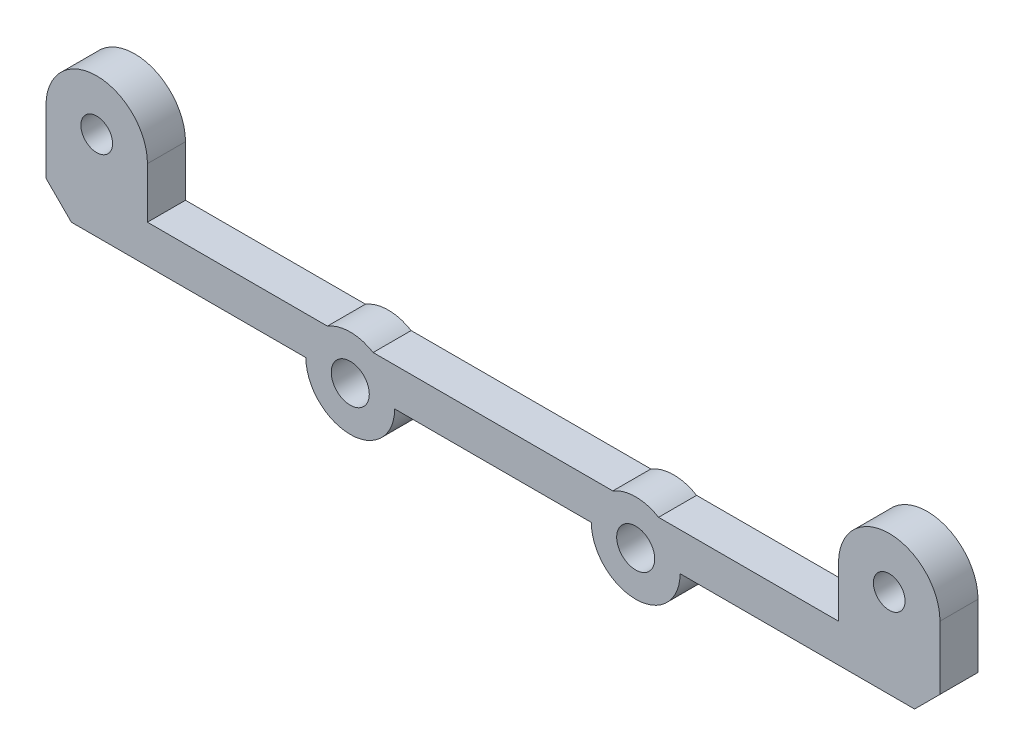
ISO-10303-21;
HEADER;
FILE_DESCRIPTION(('STEP AP214'),'2;1');
FILE_NAME('part.step','',(''),(''),'','','');
FILE_SCHEMA(('AUTOMOTIVE_DESIGN { 1 0 10303 214 1 1 1 1 }'));
ENDSEC;
DATA;
#1=APPLICATION_CONTEXT('core data for automotive mechanical design processes');
#2=APPLICATION_PROTOCOL_DEFINITION('international standard','automotive_design',2000,#1);
#3=PRODUCT_CONTEXT('',#1,'mechanical');
#4=PRODUCT('Part','Part','',(#3));
#5=PRODUCT_RELATED_PRODUCT_CATEGORY('part','',(#4));
#6=PRODUCT_DEFINITION_FORMATION('','',#4);
#7=PRODUCT_DEFINITION_CONTEXT('part definition',#1,'design');
#8=PRODUCT_DEFINITION('design','',#6,#7);
#9=PRODUCT_DEFINITION_SHAPE('','',#8);
#10=(LENGTH_UNIT() NAMED_UNIT(*) SI_UNIT(.MILLI.,.METRE.));
#11=(NAMED_UNIT(*) PLANE_ANGLE_UNIT() SI_UNIT($,.RADIAN.));
#12=(NAMED_UNIT(*) SI_UNIT($,.STERADIAN.) SOLID_ANGLE_UNIT());
#13=UNCERTAINTY_MEASURE_WITH_UNIT(LENGTH_MEASURE(1.E-05),#10,'distance_accuracy_value','');
#14=(GEOMETRIC_REPRESENTATION_CONTEXT(3) GLOBAL_UNCERTAINTY_ASSIGNED_CONTEXT((#13)) GLOBAL_UNIT_ASSIGNED_CONTEXT((#10,
#11,#12)) REPRESENTATION_CONTEXT('',''));
#15=CARTESIAN_POINT('',(0.,0.,0.));
#16=DIRECTION('',(0.,0.,1.));
#17=DIRECTION('',(1.,0.,0.));
#18=AXIS2_PLACEMENT_3D('',#15,#16,#17);
#19=CARTESIAN_POINT('',(0.,0.,3.));
#20=DIRECTION('',(0.,0.,1.));
#21=DIRECTION('',(1.,0.,0.));
#22=AXIS2_PLACEMENT_3D('',#19,#20,#21);
#23=PLANE('',#22);
#24=CARTESIAN_POINT('',(-19.995,7.,3.));
#25=DIRECTION('',(0.,0.,1.));
#26=DIRECTION('',(1.,0.,0.));
#27=AXIS2_PLACEMENT_3D('',#24,#25,#26);
#28=CIRCLE('',#27,1.25);
#29=CARTESIAN_POINT('',(-18.745,7.,3.));
#30=VERTEX_POINT('',#29);
#31=EDGE_CURVE('E432',#30,#30,#28,.T.);
#32=ORIENTED_EDGE('',*,*,#31,.F.);
#33=EDGE_LOOP('',(#32));
#34=FACE_BOUND('',#33,.T.);
#35=CARTESIAN_POINT('',(22.51,0.,3.));
#36=DIRECTION('',(0.,0.,1.));
#37=DIRECTION('',(1.,0.,0.));
#38=AXIS2_PLACEMENT_3D('',#35,#36,#37);
#39=CIRCLE('',#38,1.5);
#40=CARTESIAN_POINT('',(24.01,0.,3.));
#41=VERTEX_POINT('',#40);
#42=EDGE_CURVE('E210',#41,#41,#39,.T.);
#43=ORIENTED_EDGE('',*,*,#42,.F.);
#44=EDGE_LOOP('',(#43));
#45=FACE_BOUND('',#44,.T.);
#46=CARTESIAN_POINT('',(0.,0.,3.));
#47=DIRECTION('',(0.,0.,1.));
#48=DIRECTION('',(1.,0.,0.));
#49=AXIS2_PLACEMENT_3D('',#46,#47,#48);
#50=CIRCLE('',#49,3.5);
#51=CARTESIAN_POINT('',(-3.5,0.,3.));
#52=VERTEX_POINT('',#51);
#53=CARTESIAN_POINT('',(3.5,0.,3.));
#54=VERTEX_POINT('',#53);
#55=EDGE_CURVE('E258',#52,#54,#50,.T.);
#56=ORIENTED_EDGE('',*,*,#55,.T.);
#57=DIRECTION('',(1.,0.,0.));
#58=VECTOR('',#57,1.);
#59=CARTESIAN_POINT('',(3.5,0.,3.));
#60=LINE('',#59,#58);
#61=CARTESIAN_POINT('',(19.01,0.,3.));
#62=VERTEX_POINT('',#61);
#63=EDGE_CURVE('E134',#54,#62,#60,.T.);
#64=ORIENTED_EDGE('',*,*,#63,.T.);
#65=CARTESIAN_POINT('',(22.51,0.,3.));
#66=DIRECTION('',(0.,0.,1.));
#67=DIRECTION('',(1.,0.,0.));
#68=AXIS2_PLACEMENT_3D('',#65,#66,#67);
#69=CIRCLE('',#68,3.5);
#70=CARTESIAN_POINT('',(26.01,0.,3.));
#71=VERTEX_POINT('',#70);
#72=EDGE_CURVE('E319',#62,#71,#69,.T.);
#73=ORIENTED_EDGE('',*,*,#72,.T.);
#74=DIRECTION('',(1.,0.,0.));
#75=VECTOR('',#74,1.);
#76=CARTESIAN_POINT('',(26.01,0.,3.));
#77=LINE('',#76,#75);
#78=CARTESIAN_POINT('',(44.505,0.,3.));
#79=VERTEX_POINT('',#78);
#80=EDGE_CURVE('E339',#71,#79,#77,.T.);
#81=ORIENTED_EDGE('',*,*,#80,.T.);
#82=DIRECTION('',(0.707106781186541,0.707106781186555,0.));
#83=VECTOR('',#82,1.);
#84=CARTESIAN_POINT('',(46.505,2.,3.));
#85=LINE('',#84,#83);
#86=CARTESIAN_POINT('',(46.505,2.,3.));
#87=VERTEX_POINT('',#86);
#88=EDGE_CURVE('E335',#79,#87,#85,.T.);
#89=ORIENTED_EDGE('',*,*,#88,.T.);
#90=DIRECTION('',(0.,1.,0.));
#91=VECTOR('',#90,1.);
#92=CARTESIAN_POINT('',(46.505,2.,3.));
#93=LINE('',#92,#91);
#94=CARTESIAN_POINT('',(46.505,7.,3.));
#95=VERTEX_POINT('',#94);
#96=EDGE_CURVE('E338',#87,#95,#93,.T.);
#97=ORIENTED_EDGE('',*,*,#96,.T.);
#98=CARTESIAN_POINT('',(42.505,7.,3.));
#99=DIRECTION('',(0.,0.,1.));
#100=DIRECTION('',(1.,0.,0.));
#101=AXIS2_PLACEMENT_3D('',#98,#99,#100);
#102=CIRCLE('',#101,4.);
#103=CARTESIAN_POINT('',(38.505,7.,3.));
#104=VERTEX_POINT('',#103);
#105=EDGE_CURVE('E343',#95,#104,#102,.T.);
#106=ORIENTED_EDGE('',*,*,#105,.T.);
#107=DIRECTION('',(0.,-1.,0.));
#108=VECTOR('',#107,1.);
#109=CARTESIAN_POINT('',(38.505,2.99999999999999,3.));
#110=LINE('',#109,#108);
#111=CARTESIAN_POINT('',(38.505,2.99999999999999,3.));
#112=VERTEX_POINT('',#111);
#113=EDGE_CURVE('E350',#104,#112,#110,.T.);
#114=ORIENTED_EDGE('',*,*,#113,.T.);
#115=DIRECTION('',(-1.,0.,0.));
#116=VECTOR('',#115,1.);
#117=CARTESIAN_POINT('',(24.312775637732,2.99999999999999,3.));
#118=LINE('',#117,#116);
#119=CARTESIAN_POINT('',(24.312775637732,2.99999999999999,3.));
#120=VERTEX_POINT('',#119);
#121=EDGE_CURVE('E353',#112,#120,#118,.T.);
#122=ORIENTED_EDGE('',*,*,#121,.T.);
#123=CARTESIAN_POINT('',(22.51,0.,3.));
#124=DIRECTION('',(0.,0.,1.));
#125=DIRECTION('',(1.,0.,0.));
#126=AXIS2_PLACEMENT_3D('',#123,#124,#125);
#127=CIRCLE('',#126,3.5);
#128=CARTESIAN_POINT('',(20.707224362268,2.99999999999999,3.));
#129=VERTEX_POINT('',#128);
#130=EDGE_CURVE('E356',#120,#129,#127,.T.);
#131=ORIENTED_EDGE('',*,*,#130,.T.);
#132=DIRECTION('',(-1.,0.,0.));
#133=VECTOR('',#132,1.);
#134=CARTESIAN_POINT('',(1.80277563773201,2.99999999999999,3.));
#135=LINE('',#134,#133);
#136=CARTESIAN_POINT('',(1.80277563773201,2.99999999999999,3.));
#137=VERTEX_POINT('',#136);
#138=EDGE_CURVE('E359',#129,#137,#135,.T.);
#139=ORIENTED_EDGE('',*,*,#138,.T.);
#140=CARTESIAN_POINT('',(0.,0.,3.));
#141=DIRECTION('',(0.,0.,1.));
#142=DIRECTION('',(1.,0.,0.));
#143=AXIS2_PLACEMENT_3D('',#140,#141,#142);
#144=CIRCLE('',#143,3.5);
#145=CARTESIAN_POINT('',(-1.80277563773201,2.99999999999999,3.));
#146=VERTEX_POINT('',#145);
#147=EDGE_CURVE('E362',#137,#146,#144,.T.);
#148=ORIENTED_EDGE('',*,*,#147,.T.);
#149=DIRECTION('',(-1.,0.,0.));
#150=VECTOR('',#149,1.);
#151=CARTESIAN_POINT('',(-15.995,2.99999999999999,3.));
#152=LINE('',#151,#150);
#153=CARTESIAN_POINT('',(-15.995,2.99999999999999,3.));
#154=VERTEX_POINT('',#153);
#155=EDGE_CURVE('E365',#146,#154,#152,.T.);
#156=ORIENTED_EDGE('',*,*,#155,.T.);
#157=DIRECTION('',(0.,1.,0.));
#158=VECTOR('',#157,1.);
#159=CARTESIAN_POINT('',(-15.995,7.,3.));
#160=LINE('',#159,#158);
#161=CARTESIAN_POINT('',(-15.995,7.,3.));
#162=VERTEX_POINT('',#161);
#163=EDGE_CURVE('E368',#154,#162,#160,.T.);
#164=ORIENTED_EDGE('',*,*,#163,.T.);
#165=CARTESIAN_POINT('',(-19.995,7.,3.));
#166=DIRECTION('',(0.,0.,1.));
#167=DIRECTION('',(1.,0.,0.));
#168=AXIS2_PLACEMENT_3D('',#165,#166,#167);
#169=CIRCLE('',#168,4.);
#170=CARTESIAN_POINT('',(-23.995,7.,3.));
#171=VERTEX_POINT('',#170);
#172=EDGE_CURVE('E183',#162,#171,#169,.T.);
#173=ORIENTED_EDGE('',*,*,#172,.T.);
#174=DIRECTION('',(0.,-1.,0.));
#175=VECTOR('',#174,1.);
#176=CARTESIAN_POINT('',(-23.995,7.,3.));
#177=LINE('',#176,#175);
#178=CARTESIAN_POINT('',(-23.995,2.,3.));
#179=VERTEX_POINT('',#178);
#180=EDGE_CURVE('E177',#171,#179,#177,.T.);
#181=ORIENTED_EDGE('',*,*,#180,.T.);
#182=DIRECTION('',(0.707106781186554,-0.707106781186541,0.));
#183=VECTOR('',#182,1.);
#184=CARTESIAN_POINT('',(-23.995,2.,3.));
#185=LINE('',#184,#183);
#186=CARTESIAN_POINT('',(-21.995,0.,3.));
#187=VERTEX_POINT('',#186);
#188=EDGE_CURVE('E181',#179,#187,#185,.T.);
#189=ORIENTED_EDGE('',*,*,#188,.T.);
#190=DIRECTION('',(1.,0.,0.));
#191=VECTOR('',#190,1.);
#192=CARTESIAN_POINT('',(-21.995,0.,3.));
#193=LINE('',#192,#191);
#194=EDGE_CURVE('E61',#187,#52,#193,.T.);
#195=ORIENTED_EDGE('',*,*,#194,.T.);
#196=EDGE_LOOP('',(#56,#64,#73,#81,#89,#97,#106,#114,#122,#131,#139,#148,#156,#164,#173,#181,
#189,#195));
#197=FACE_BOUND('',#196,.T.);
#198=CARTESIAN_POINT('',(0.,0.,3.));
#199=DIRECTION('',(0.,0.,1.));
#200=DIRECTION('',(1.,0.,0.));
#201=AXIS2_PLACEMENT_3D('',#198,#199,#200);
#202=CIRCLE('',#201,1.5);
#203=CARTESIAN_POINT('',(1.5,0.,3.));
#204=VERTEX_POINT('',#203);
#205=EDGE_CURVE('E440',#204,#204,#202,.T.);
#206=ORIENTED_EDGE('',*,*,#205,.F.);
#207=EDGE_LOOP('',(#206));
#208=FACE_BOUND('',#207,.T.);
#209=CARTESIAN_POINT('',(42.505,7.,3.));
#210=DIRECTION('',(0.,0.,1.));
#211=DIRECTION('',(1.,0.,0.));
#212=AXIS2_PLACEMENT_3D('',#209,#210,#211);
#213=CIRCLE('',#212,1.25);
#214=CARTESIAN_POINT('',(43.755,7.,3.));
#215=VERTEX_POINT('',#214);
#216=EDGE_CURVE('E421',#215,#215,#213,.T.);
#217=ORIENTED_EDGE('',*,*,#216,.F.);
#218=EDGE_LOOP('',(#217));
#219=FACE_BOUND('',#218,.T.);
#220=ADVANCED_FACE('F43',(#34,#45,#197,#208,#219),#23,.T.);
#221=CARTESIAN_POINT('',(0.,0.,0.));
#222=DIRECTION('',(0.,0.,1.));
#223=DIRECTION('',(1.,0.,0.));
#224=AXIS2_PLACEMENT_3D('',#221,#222,#223);
#225=PLANE('',#224);
#226=CARTESIAN_POINT('',(0.,0.,0.));
#227=DIRECTION('',(0.,0.,1.));
#228=DIRECTION('',(1.,0.,0.));
#229=AXIS2_PLACEMENT_3D('',#226,#227,#228);
#230=CIRCLE('',#229,3.5);
#231=CARTESIAN_POINT('',(-3.5,0.,0.));
#232=VERTEX_POINT('',#231);
#233=CARTESIAN_POINT('',(3.5,0.,0.));
#234=VERTEX_POINT('',#233);
#235=EDGE_CURVE('E205',#232,#234,#230,.T.);
#236=ORIENTED_EDGE('',*,*,#235,.F.);
#237=DIRECTION('',(1.,0.,0.));
#238=VECTOR('',#237,1.);
#239=CARTESIAN_POINT('',(-21.995,0.,0.));
#240=LINE('',#239,#238);
#241=CARTESIAN_POINT('',(-21.995,0.,0.));
#242=VERTEX_POINT('',#241);
#243=EDGE_CURVE('E126',#242,#232,#240,.T.);
#244=ORIENTED_EDGE('',*,*,#243,.F.);
#245=DIRECTION('',(0.707106781186554,-0.707106781186541,0.));
#246=VECTOR('',#245,1.);
#247=CARTESIAN_POINT('',(-23.995,2.,0.));
#248=LINE('',#247,#246);
#249=CARTESIAN_POINT('',(-23.995,2.,0.));
#250=VERTEX_POINT('',#249);
#251=EDGE_CURVE('E120',#250,#242,#248,.T.);
#252=ORIENTED_EDGE('',*,*,#251,.F.);
#253=DIRECTION('',(0.,-1.,0.));
#254=VECTOR('',#253,1.);
#255=CARTESIAN_POINT('',(-23.995,7.,0.));
#256=LINE('',#255,#254);
#257=CARTESIAN_POINT('',(-23.995,7.,0.));
#258=VERTEX_POINT('',#257);
#259=EDGE_CURVE('E192',#258,#250,#256,.T.);
#260=ORIENTED_EDGE('',*,*,#259,.F.);
#261=CARTESIAN_POINT('',(-19.995,7.,0.));
#262=DIRECTION('',(0.,0.,1.));
#263=DIRECTION('',(1.,0.,0.));
#264=AXIS2_PLACEMENT_3D('',#261,#262,#263);
#265=CIRCLE('',#264,4.);
#266=CARTESIAN_POINT('',(-15.995,7.,0.));
#267=VERTEX_POINT('',#266);
#268=EDGE_CURVE('E249',#267,#258,#265,.T.);
#269=ORIENTED_EDGE('',*,*,#268,.F.);
#270=DIRECTION('',(0.,1.,0.));
#271=VECTOR('',#270,1.);
#272=CARTESIAN_POINT('',(-15.995,7.,0.));
#273=LINE('',#272,#271);
#274=CARTESIAN_POINT('',(-15.995,2.99999999999999,0.));
#275=VERTEX_POINT('',#274);
#276=EDGE_CURVE('E246',#275,#267,#273,.T.);
#277=ORIENTED_EDGE('',*,*,#276,.F.);
#278=DIRECTION('',(-1.,0.,0.));
#279=VECTOR('',#278,1.);
#280=CARTESIAN_POINT('',(-15.995,2.99999999999999,0.));
#281=LINE('',#280,#279);
#282=CARTESIAN_POINT('',(-1.80277563773201,2.99999999999999,0.));
#283=VERTEX_POINT('',#282);
#284=EDGE_CURVE('E243',#283,#275,#281,.T.);
#285=ORIENTED_EDGE('',*,*,#284,.F.);
#286=CARTESIAN_POINT('',(0.,0.,0.));
#287=DIRECTION('',(0.,0.,1.));
#288=DIRECTION('',(1.,0.,0.));
#289=AXIS2_PLACEMENT_3D('',#286,#287,#288);
#290=CIRCLE('',#289,3.5);
#291=CARTESIAN_POINT('',(1.80277563773201,2.99999999999999,0.));
#292=VERTEX_POINT('',#291);
#293=EDGE_CURVE('E240',#292,#283,#290,.T.);
#294=ORIENTED_EDGE('',*,*,#293,.F.);
#295=DIRECTION('',(-1.,0.,0.));
#296=VECTOR('',#295,1.);
#297=CARTESIAN_POINT('',(1.80277563773201,2.99999999999999,0.));
#298=LINE('',#297,#296);
#299=CARTESIAN_POINT('',(20.707224362268,2.99999999999999,0.));
#300=VERTEX_POINT('',#299);
#301=EDGE_CURVE('E237',#300,#292,#298,.T.);
#302=ORIENTED_EDGE('',*,*,#301,.F.);
#303=CARTESIAN_POINT('',(22.51,0.,0.));
#304=DIRECTION('',(0.,0.,1.));
#305=DIRECTION('',(1.,0.,0.));
#306=AXIS2_PLACEMENT_3D('',#303,#304,#305);
#307=CIRCLE('',#306,3.5);
#308=CARTESIAN_POINT('',(24.312775637732,2.99999999999999,0.));
#309=VERTEX_POINT('',#308);
#310=EDGE_CURVE('E234',#309,#300,#307,.T.);
#311=ORIENTED_EDGE('',*,*,#310,.F.);
#312=DIRECTION('',(-1.,0.,0.));
#313=VECTOR('',#312,1.);
#314=CARTESIAN_POINT('',(24.312775637732,2.99999999999999,0.));
#315=LINE('',#314,#313);
#316=CARTESIAN_POINT('',(38.505,2.99999999999999,0.));
#317=VERTEX_POINT('',#316);
#318=EDGE_CURVE('E231',#317,#309,#315,.T.);
#319=ORIENTED_EDGE('',*,*,#318,.F.);
#320=DIRECTION('',(0.,-1.,0.));
#321=VECTOR('',#320,1.);
#322=CARTESIAN_POINT('',(38.505,2.99999999999999,0.));
#323=LINE('',#322,#321);
#324=CARTESIAN_POINT('',(38.505,7.,0.));
#325=VERTEX_POINT('',#324);
#326=EDGE_CURVE('E228',#325,#317,#323,.T.);
#327=ORIENTED_EDGE('',*,*,#326,.F.);
#328=CARTESIAN_POINT('',(42.505,7.,0.));
#329=DIRECTION('',(0.,0.,1.));
#330=DIRECTION('',(1.,0.,0.));
#331=AXIS2_PLACEMENT_3D('',#328,#329,#330);
#332=CIRCLE('',#331,4.);
#333=CARTESIAN_POINT('',(46.505,7.,0.));
#334=VERTEX_POINT('',#333);
#335=EDGE_CURVE('E225',#334,#325,#332,.T.);
#336=ORIENTED_EDGE('',*,*,#335,.F.);
#337=DIRECTION('',(0.,1.,0.));
#338=VECTOR('',#337,1.);
#339=CARTESIAN_POINT('',(46.505,2.,0.));
#340=LINE('',#339,#338);
#341=CARTESIAN_POINT('',(46.505,2.,0.));
#342=VERTEX_POINT('',#341);
#343=EDGE_CURVE('E222',#342,#334,#340,.T.);
#344=ORIENTED_EDGE('',*,*,#343,.F.);
#345=DIRECTION('',(0.707106781186541,0.707106781186555,0.));
#346=VECTOR('',#345,1.);
#347=CARTESIAN_POINT('',(46.505,2.,0.));
#348=LINE('',#347,#346);
#349=CARTESIAN_POINT('',(44.505,0.,0.));
#350=VERTEX_POINT('',#349);
#351=EDGE_CURVE('E219',#350,#342,#348,.T.);
#352=ORIENTED_EDGE('',*,*,#351,.F.);
#353=DIRECTION('',(1.,0.,0.));
#354=VECTOR('',#353,1.);
#355=CARTESIAN_POINT('',(26.01,0.,0.));
#356=LINE('',#355,#354);
#357=CARTESIAN_POINT('',(26.01,0.,0.));
#358=VERTEX_POINT('',#357);
#359=EDGE_CURVE('E216',#358,#350,#356,.T.);
#360=ORIENTED_EDGE('',*,*,#359,.F.);
#361=CARTESIAN_POINT('',(22.51,0.,0.));
#362=DIRECTION('',(0.,0.,1.));
#363=DIRECTION('',(1.,0.,0.));
#364=AXIS2_PLACEMENT_3D('',#361,#362,#363);
#365=CIRCLE('',#364,3.5);
#366=CARTESIAN_POINT('',(19.01,0.,0.));
#367=VERTEX_POINT('',#366);
#368=EDGE_CURVE('E213',#367,#358,#365,.T.);
#369=ORIENTED_EDGE('',*,*,#368,.F.);
#370=DIRECTION('',(1.,0.,0.));
#371=VECTOR('',#370,1.);
#372=CARTESIAN_POINT('',(3.5,0.,0.));
#373=LINE('',#372,#371);
#374=EDGE_CURVE('E209',#234,#367,#373,.T.);
#375=ORIENTED_EDGE('',*,*,#374,.F.);
#376=EDGE_LOOP('',(#236,#244,#252,#260,#269,#277,#285,#294,#302,#311,#319,#327,#336,#344,#352,
#360,#369,#375));
#377=FACE_BOUND('',#376,.T.);
#378=CARTESIAN_POINT('',(22.51,0.,0.));
#379=DIRECTION('',(0.,0.,1.));
#380=DIRECTION('',(1.,0.,0.));
#381=AXIS2_PLACEMENT_3D('',#378,#379,#380);
#382=CIRCLE('',#381,1.5);
#383=CARTESIAN_POINT('',(24.01,0.,0.));
#384=VERTEX_POINT('',#383);
#385=EDGE_CURVE('E444',#384,#384,#382,.T.);
#386=ORIENTED_EDGE('',*,*,#385,.T.);
#387=EDGE_LOOP('',(#386));
#388=FACE_BOUND('',#387,.T.);
#389=CARTESIAN_POINT('',(0.,0.,0.));
#390=DIRECTION('',(0.,0.,1.));
#391=DIRECTION('',(1.,0.,0.));
#392=AXIS2_PLACEMENT_3D('',#389,#390,#391);
#393=CIRCLE('',#392,1.5);
#394=CARTESIAN_POINT('',(1.5,0.,0.));
#395=VERTEX_POINT('',#394);
#396=EDGE_CURVE('E436',#395,#395,#393,.T.);
#397=ORIENTED_EDGE('',*,*,#396,.T.);
#398=EDGE_LOOP('',(#397));
#399=FACE_BOUND('',#398,.T.);
#400=CARTESIAN_POINT('',(-19.995,7.,0.));
#401=DIRECTION('',(0.,0.,1.));
#402=DIRECTION('',(1.,0.,0.));
#403=AXIS2_PLACEMENT_3D('',#400,#401,#402);
#404=CIRCLE('',#403,1.25);
#405=CARTESIAN_POINT('',(-18.745,7.,0.));
#406=VERTEX_POINT('',#405);
#407=EDGE_CURVE('E429',#406,#406,#404,.T.);
#408=ORIENTED_EDGE('',*,*,#407,.T.);
#409=EDGE_LOOP('',(#408));
#410=FACE_BOUND('',#409,.T.);
#411=CARTESIAN_POINT('',(42.505,7.,0.));
#412=DIRECTION('',(0.,0.,1.));
#413=DIRECTION('',(1.,0.,0.));
#414=AXIS2_PLACEMENT_3D('',#411,#412,#413);
#415=CIRCLE('',#414,1.25);
#416=CARTESIAN_POINT('',(43.755,7.,0.));
#417=VERTEX_POINT('',#416);
#418=EDGE_CURVE('E424',#417,#417,#415,.T.);
#419=ORIENTED_EDGE('',*,*,#418,.T.);
#420=EDGE_LOOP('',(#419));
#421=FACE_BOUND('',#420,.T.);
#422=ADVANCED_FACE('F323',(#377,#388,#399,#410,#421),#225,.F.);
#423=CARTESIAN_POINT('',(0.,0.,3.));
#424=DIRECTION('',(0.,0.,-1.));
#425=DIRECTION('',(-1.,0.,0.));
#426=AXIS2_PLACEMENT_3D('',#423,#424,#425);
#427=CYLINDRICAL_SURFACE('',#426,3.5);
#428=ORIENTED_EDGE('',*,*,#235,.T.);
#429=DIRECTION('',(0.,0.,-1.));
#430=VECTOR('',#429,1.);
#431=CARTESIAN_POINT('',(3.5,0.,3.));
#432=LINE('',#431,#430);
#433=EDGE_CURVE('E11',#54,#234,#432,.T.);
#434=ORIENTED_EDGE('',*,*,#433,.F.);
#435=ORIENTED_EDGE('',*,*,#55,.F.);
#436=DIRECTION('',(0.,0.,-1.));
#437=VECTOR('',#436,1.);
#438=CARTESIAN_POINT('',(-3.5,0.,3.));
#439=LINE('',#438,#437);
#440=EDGE_CURVE('E201',#52,#232,#439,.T.);
#441=ORIENTED_EDGE('',*,*,#440,.T.);
#442=EDGE_LOOP('',(#428,#434,#435,#441));
#443=FACE_BOUND('',#442,.T.);
#444=ADVANCED_FACE('F45',(#443),#427,.T.);
#445=CARTESIAN_POINT('',(3.5,0.,3.));
#446=DIRECTION('',(0.,1.,0.));
#447=DIRECTION('',(0.,0.,1.));
#448=AXIS2_PLACEMENT_3D('',#445,#446,#447);
#449=PLANE('',#448);
#450=ORIENTED_EDGE('',*,*,#374,.T.);
#451=DIRECTION('',(0.,0.,-1.));
#452=VECTOR('',#451,1.);
#453=CARTESIAN_POINT('',(19.01,0.,3.));
#454=LINE('',#453,#452);
#455=EDGE_CURVE('E53',#62,#367,#454,.T.);
#456=ORIENTED_EDGE('',*,*,#455,.F.);
#457=ORIENTED_EDGE('',*,*,#63,.F.);
#458=ORIENTED_EDGE('',*,*,#433,.T.);
#459=EDGE_LOOP('',(#450,#456,#457,#458));
#460=FACE_BOUND('',#459,.T.);
#461=ADVANCED_FACE('F636',(#460),#449,.F.);
#462=CARTESIAN_POINT('',(22.51,0.,3.));
#463=DIRECTION('',(0.,0.,-1.));
#464=DIRECTION('',(-1.,0.,0.));
#465=AXIS2_PLACEMENT_3D('',#462,#463,#464);
#466=CYLINDRICAL_SURFACE('',#465,3.5);
#467=ORIENTED_EDGE('',*,*,#368,.T.);
#468=DIRECTION('',(0.,0.,-1.));
#469=VECTOR('',#468,1.);
#470=CARTESIAN_POINT('',(26.01,0.,3.));
#471=LINE('',#470,#469);
#472=EDGE_CURVE('E309',#71,#358,#471,.T.);
#473=ORIENTED_EDGE('',*,*,#472,.F.);
#474=ORIENTED_EDGE('',*,*,#72,.F.);
#475=ORIENTED_EDGE('',*,*,#455,.T.);
#476=EDGE_LOOP('',(#467,#473,#474,#475));
#477=FACE_BOUND('',#476,.T.);
#478=ADVANCED_FACE('F317',(#477),#466,.T.);
#479=CARTESIAN_POINT('',(26.01,0.,3.));
#480=DIRECTION('',(0.,1.,0.));
#481=DIRECTION('',(-1.,0.,0.));
#482=AXIS2_PLACEMENT_3D('',#479,#480,#481);
#483=PLANE('',#482);
#484=ORIENTED_EDGE('',*,*,#359,.T.);
#485=DIRECTION('',(0.,0.,-1.));
#486=VECTOR('',#485,1.);
#487=CARTESIAN_POINT('',(44.505,0.,3.));
#488=LINE('',#487,#486);
#489=EDGE_CURVE('E305',#79,#350,#488,.T.);
#490=ORIENTED_EDGE('',*,*,#489,.F.);
#491=ORIENTED_EDGE('',*,*,#80,.F.);
#492=ORIENTED_EDGE('',*,*,#472,.T.);
#493=EDGE_LOOP('',(#484,#490,#491,#492));
#494=FACE_BOUND('',#493,.T.);
#495=ADVANCED_FACE('F329',(#494),#483,.F.);
#496=CARTESIAN_POINT('',(46.505,2.,3.));
#497=DIRECTION('',(-0.707106781186554,0.70710678118654,0.));
#498=DIRECTION('',(-0.70710678118654,-0.707106781186554,0.));
#499=AXIS2_PLACEMENT_3D('',#496,#497,#498);
#500=PLANE('',#499);
#501=ORIENTED_EDGE('',*,*,#351,.T.);
#502=DIRECTION('',(0.,0.,-1.));
#503=VECTOR('',#502,1.);
#504=CARTESIAN_POINT('',(46.505,2.,3.));
#505=LINE('',#504,#503);
#506=EDGE_CURVE('E301',#87,#342,#505,.T.);
#507=ORIENTED_EDGE('',*,*,#506,.F.);
#508=ORIENTED_EDGE('',*,*,#88,.F.);
#509=ORIENTED_EDGE('',*,*,#489,.T.);
#510=EDGE_LOOP('',(#501,#507,#508,#509));
#511=FACE_BOUND('',#510,.T.);
#512=ADVANCED_FACE('F333',(#511),#500,.F.);
#513=CARTESIAN_POINT('',(46.505,2.,3.));
#514=DIRECTION('',(-1.,0.,0.));
#515=DIRECTION('',(0.,0.,1.));
#516=AXIS2_PLACEMENT_3D('',#513,#514,#515);
#517=PLANE('',#516);
#518=ORIENTED_EDGE('',*,*,#343,.T.);
#519=DIRECTION('',(0.,0.,-1.));
#520=VECTOR('',#519,1.);
#521=CARTESIAN_POINT('',(46.505,7.,3.));
#522=LINE('',#521,#520);
#523=EDGE_CURVE('E297',#95,#334,#522,.T.);
#524=ORIENTED_EDGE('',*,*,#523,.F.);
#525=ORIENTED_EDGE('',*,*,#96,.F.);
#526=ORIENTED_EDGE('',*,*,#506,.T.);
#527=EDGE_LOOP('',(#518,#524,#525,#526));
#528=FACE_BOUND('',#527,.T.);
#529=ADVANCED_FACE('F597',(#528),#517,.F.);
#530=CARTESIAN_POINT('',(42.505,7.,3.));
#531=DIRECTION('',(0.,0.,-1.));
#532=DIRECTION('',(-1.,0.,0.));
#533=AXIS2_PLACEMENT_3D('',#530,#531,#532);
#534=CYLINDRICAL_SURFACE('',#533,4.);
#535=ORIENTED_EDGE('',*,*,#335,.T.);
#536=DIRECTION('',(0.,0.,-1.));
#537=VECTOR('',#536,1.);
#538=CARTESIAN_POINT('',(38.505,7.,3.));
#539=LINE('',#538,#537);
#540=EDGE_CURVE('E293',#104,#325,#539,.T.);
#541=ORIENTED_EDGE('',*,*,#540,.F.);
#542=ORIENTED_EDGE('',*,*,#105,.F.);
#543=ORIENTED_EDGE('',*,*,#523,.T.);
#544=EDGE_LOOP('',(#535,#541,#542,#543));
#545=FACE_BOUND('',#544,.T.);
#546=ADVANCED_FACE('F586',(#545),#534,.T.);
#547=CARTESIAN_POINT('',(38.505,2.99999999999999,3.));
#548=DIRECTION('',(1.,0.,0.));
#549=DIRECTION('',(0.,0.,-1.));
#550=AXIS2_PLACEMENT_3D('',#547,#548,#549);
#551=PLANE('',#550);
#552=ORIENTED_EDGE('',*,*,#326,.T.);
#553=DIRECTION('',(0.,0.,-1.));
#554=VECTOR('',#553,1.);
#555=CARTESIAN_POINT('',(38.505,2.99999999999999,3.));
#556=LINE('',#555,#554);
#557=EDGE_CURVE('E289',#112,#317,#556,.T.);
#558=ORIENTED_EDGE('',*,*,#557,.F.);
#559=ORIENTED_EDGE('',*,*,#113,.F.);
#560=ORIENTED_EDGE('',*,*,#540,.T.);
#561=EDGE_LOOP('',(#552,#558,#559,#560));
#562=FACE_BOUND('',#561,.T.);
#563=ADVANCED_FACE('F575',(#562),#551,.F.);
#564=CARTESIAN_POINT('',(24.312775637732,2.99999999999999,3.));
#565=DIRECTION('',(0.,-1.,0.));
#566=DIRECTION('',(0.,0.,-1.));
#567=AXIS2_PLACEMENT_3D('',#564,#565,#566);
#568=PLANE('',#567);
#569=ORIENTED_EDGE('',*,*,#318,.T.);
#570=DIRECTION('',(0.,0.,-1.));
#571=VECTOR('',#570,1.);
#572=CARTESIAN_POINT('',(24.312775637732,2.99999999999999,3.));
#573=LINE('',#572,#571);
#574=EDGE_CURVE('E285',#120,#309,#573,.T.);
#575=ORIENTED_EDGE('',*,*,#574,.F.);
#576=ORIENTED_EDGE('',*,*,#121,.F.);
#577=ORIENTED_EDGE('',*,*,#557,.T.);
#578=EDGE_LOOP('',(#569,#575,#576,#577));
#579=FACE_BOUND('',#578,.T.);
#580=ADVANCED_FACE('F564',(#579),#568,.F.);
#581=CARTESIAN_POINT('',(22.51,0.,3.));
#582=DIRECTION('',(0.,0.,-1.));
#583=DIRECTION('',(-1.,0.,0.));
#584=AXIS2_PLACEMENT_3D('',#581,#582,#583);
#585=CYLINDRICAL_SURFACE('',#584,3.5);
#586=ORIENTED_EDGE('',*,*,#310,.T.);
#587=DIRECTION('',(0.,0.,-1.));
#588=VECTOR('',#587,1.);
#589=CARTESIAN_POINT('',(20.707224362268,2.99999999999999,3.));
#590=LINE('',#589,#588);
#591=EDGE_CURVE('E281',#129,#300,#590,.T.);
#592=ORIENTED_EDGE('',*,*,#591,.F.);
#593=ORIENTED_EDGE('',*,*,#130,.F.);
#594=ORIENTED_EDGE('',*,*,#574,.T.);
#595=EDGE_LOOP('',(#586,#592,#593,#594));
#596=FACE_BOUND('',#595,.T.);
#597=ADVANCED_FACE('F553',(#596),#585,.T.);
#598=CARTESIAN_POINT('',(1.80277563773201,2.99999999999999,3.));
#599=DIRECTION('',(0.,-1.,0.));
#600=DIRECTION('',(0.,0.,-1.));
#601=AXIS2_PLACEMENT_3D('',#598,#599,#600);
#602=PLANE('',#601);
#603=ORIENTED_EDGE('',*,*,#301,.T.);
#604=DIRECTION('',(0.,0.,-1.));
#605=VECTOR('',#604,1.);
#606=CARTESIAN_POINT('',(1.80277563773201,2.99999999999999,3.));
#607=LINE('',#606,#605);
#608=EDGE_CURVE('E277',#137,#292,#607,.T.);
#609=ORIENTED_EDGE('',*,*,#608,.F.);
#610=ORIENTED_EDGE('',*,*,#138,.F.);
#611=ORIENTED_EDGE('',*,*,#591,.T.);
#612=EDGE_LOOP('',(#603,#609,#610,#611));
#613=FACE_BOUND('',#612,.T.);
#614=ADVANCED_FACE('F542',(#613),#602,.F.);
#615=CARTESIAN_POINT('',(0.,0.,3.));
#616=DIRECTION('',(0.,0.,-1.));
#617=DIRECTION('',(-1.,0.,0.));
#618=AXIS2_PLACEMENT_3D('',#615,#616,#617);
#619=CYLINDRICAL_SURFACE('',#618,3.5);
#620=ORIENTED_EDGE('',*,*,#293,.T.);
#621=DIRECTION('',(0.,0.,-1.));
#622=VECTOR('',#621,1.);
#623=CARTESIAN_POINT('',(-1.80277563773201,2.99999999999999,3.));
#624=LINE('',#623,#622);
#625=EDGE_CURVE('E273',#146,#283,#624,.T.);
#626=ORIENTED_EDGE('',*,*,#625,.F.);
#627=ORIENTED_EDGE('',*,*,#147,.F.);
#628=ORIENTED_EDGE('',*,*,#608,.T.);
#629=EDGE_LOOP('',(#620,#626,#627,#628));
#630=FACE_BOUND('',#629,.T.);
#631=ADVANCED_FACE('F531',(#630),#619,.T.);
#632=CARTESIAN_POINT('',(-15.995,2.99999999999999,3.));
#633=DIRECTION('',(0.,-1.,0.));
#634=DIRECTION('',(0.,0.,-1.));
#635=AXIS2_PLACEMENT_3D('',#632,#633,#634);
#636=PLANE('',#635);
#637=ORIENTED_EDGE('',*,*,#284,.T.);
#638=DIRECTION('',(0.,0.,-1.));
#639=VECTOR('',#638,1.);
#640=CARTESIAN_POINT('',(-15.995,2.99999999999999,3.));
#641=LINE('',#640,#639);
#642=EDGE_CURVE('E269',#154,#275,#641,.T.);
#643=ORIENTED_EDGE('',*,*,#642,.F.);
#644=ORIENTED_EDGE('',*,*,#155,.F.);
#645=ORIENTED_EDGE('',*,*,#625,.T.);
#646=EDGE_LOOP('',(#637,#643,#644,#645));
#647=FACE_BOUND('',#646,.T.);
#648=ADVANCED_FACE('F521',(#647),#636,.F.);
#649=CARTESIAN_POINT('',(-15.995,7.,3.));
#650=DIRECTION('',(-1.,0.,0.));
#651=DIRECTION('',(0.,0.,1.));
#652=AXIS2_PLACEMENT_3D('',#649,#650,#651);
#653=PLANE('',#652);
#654=ORIENTED_EDGE('',*,*,#276,.T.);
#655=DIRECTION('',(0.,0.,-1.));
#656=VECTOR('',#655,1.);
#657=CARTESIAN_POINT('',(-15.995,7.,3.));
#658=LINE('',#657,#656);
#659=EDGE_CURVE('E265',#162,#267,#658,.T.);
#660=ORIENTED_EDGE('',*,*,#659,.F.);
#661=ORIENTED_EDGE('',*,*,#163,.F.);
#662=ORIENTED_EDGE('',*,*,#642,.T.);
#663=EDGE_LOOP('',(#654,#660,#661,#662));
#664=FACE_BOUND('',#663,.T.);
#665=ADVANCED_FACE('F376',(#664),#653,.F.);
#666=CARTESIAN_POINT('',(-19.995,7.,3.));
#667=DIRECTION('',(0.,0.,-1.));
#668=DIRECTION('',(-1.,0.,0.));
#669=AXIS2_PLACEMENT_3D('',#666,#667,#668);
#670=CYLINDRICAL_SURFACE('',#669,4.);
#671=ORIENTED_EDGE('',*,*,#268,.T.);
#672=DIRECTION('',(0.,0.,-1.));
#673=VECTOR('',#672,1.);
#674=CARTESIAN_POINT('',(-23.995,7.,3.));
#675=LINE('',#674,#673);
#676=EDGE_CURVE('E194',#171,#258,#675,.T.);
#677=ORIENTED_EDGE('',*,*,#676,.F.);
#678=ORIENTED_EDGE('',*,*,#172,.F.);
#679=ORIENTED_EDGE('',*,*,#659,.T.);
#680=EDGE_LOOP('',(#671,#677,#678,#679));
#681=FACE_BOUND('',#680,.T.);
#682=ADVANCED_FACE('F380',(#681),#670,.T.);
#683=CARTESIAN_POINT('',(-23.995,7.,3.));
#684=DIRECTION('',(1.,0.,0.));
#685=DIRECTION('',(0.,0.,-1.));
#686=AXIS2_PLACEMENT_3D('',#683,#684,#685);
#687=PLANE('',#686);
#688=ORIENTED_EDGE('',*,*,#259,.T.);
#689=DIRECTION('',(0.,0.,-1.));
#690=VECTOR('',#689,1.);
#691=CARTESIAN_POINT('',(-23.995,2.,3.));
#692=LINE('',#691,#690);
#693=EDGE_CURVE('E189',#179,#250,#692,.T.);
#694=ORIENTED_EDGE('',*,*,#693,.F.);
#695=ORIENTED_EDGE('',*,*,#180,.F.);
#696=ORIENTED_EDGE('',*,*,#676,.T.);
#697=EDGE_LOOP('',(#688,#694,#695,#696));
#698=FACE_BOUND('',#697,.T.);
#699=ADVANCED_FACE('F190',(#698),#687,.F.);
#700=CARTESIAN_POINT('',(-23.995,2.,3.));
#701=DIRECTION('',(0.707106781186541,0.707106781186554,0.));
#702=DIRECTION('',(-0.707106781186554,0.707106781186541,0.));
#703=AXIS2_PLACEMENT_3D('',#700,#701,#702);
#704=PLANE('',#703);
#705=ORIENTED_EDGE('',*,*,#251,.T.);
#706=DIRECTION('',(0.,0.,-1.));
#707=VECTOR('',#706,1.);
#708=CARTESIAN_POINT('',(-21.995,0.,3.));
#709=LINE('',#708,#707);
#710=EDGE_CURVE('E195',#187,#242,#709,.T.);
#711=ORIENTED_EDGE('',*,*,#710,.F.);
#712=ORIENTED_EDGE('',*,*,#188,.F.);
#713=ORIENTED_EDGE('',*,*,#693,.T.);
#714=EDGE_LOOP('',(#705,#711,#712,#713));
#715=FACE_BOUND('',#714,.T.);
#716=ADVANCED_FACE('F197',(#715),#704,.F.);
#717=CARTESIAN_POINT('',(-21.995,0.,3.));
#718=DIRECTION('',(0.,1.,0.));
#719=DIRECTION('',(-1.,0.,0.));
#720=AXIS2_PLACEMENT_3D('',#717,#718,#719);
#721=PLANE('',#720);
#722=ORIENTED_EDGE('',*,*,#243,.T.);
#723=ORIENTED_EDGE('',*,*,#440,.F.);
#724=ORIENTED_EDGE('',*,*,#194,.F.);
#725=ORIENTED_EDGE('',*,*,#710,.T.);
#726=EDGE_LOOP('',(#722,#723,#724,#725));
#727=FACE_BOUND('',#726,.T.);
#728=ADVANCED_FACE('F384',(#727),#721,.F.);
#729=CARTESIAN_POINT('',(22.51,0.,3.));
#730=DIRECTION('',(0.,0.,-1.));
#731=DIRECTION('',(-1.,0.,0.));
#732=AXIS2_PLACEMENT_3D('',#729,#730,#731);
#733=CYLINDRICAL_SURFACE('',#732,1.5);
#734=ORIENTED_EDGE('',*,*,#42,.T.);
#735=EDGE_LOOP('',(#734));
#736=FACE_BOUND('',#735,.T.);
#737=ORIENTED_EDGE('',*,*,#385,.F.);
#738=EDGE_LOOP('',(#737));
#739=FACE_BOUND('',#738,.T.);
#740=ADVANCED_FACE('F386',(#736,#739),#733,.F.);
#741=CARTESIAN_POINT('',(0.,0.,3.));
#742=DIRECTION('',(0.,0.,-1.));
#743=DIRECTION('',(-1.,0.,0.));
#744=AXIS2_PLACEMENT_3D('',#741,#742,#743);
#745=CYLINDRICAL_SURFACE('',#744,1.5);
#746=ORIENTED_EDGE('',*,*,#205,.T.);
#747=EDGE_LOOP('',(#746));
#748=FACE_BOUND('',#747,.T.);
#749=ORIENTED_EDGE('',*,*,#396,.F.);
#750=EDGE_LOOP('',(#749));
#751=FACE_BOUND('',#750,.T.);
#752=ADVANCED_FACE('F392',(#748,#751),#745,.F.);
#753=CARTESIAN_POINT('',(-19.995,7.,3.));
#754=DIRECTION('',(0.,0.,-1.));
#755=DIRECTION('',(-1.,0.,0.));
#756=AXIS2_PLACEMENT_3D('',#753,#754,#755);
#757=CYLINDRICAL_SURFACE('',#756,1.25);
#758=ORIENTED_EDGE('',*,*,#31,.T.);
#759=EDGE_LOOP('',(#758));
#760=FACE_BOUND('',#759,.T.);
#761=ORIENTED_EDGE('',*,*,#407,.F.);
#762=EDGE_LOOP('',(#761));
#763=FACE_BOUND('',#762,.T.);
#764=ADVANCED_FACE('F408',(#760,#763),#757,.F.);
#765=CARTESIAN_POINT('',(42.505,7.,3.));
#766=DIRECTION('',(0.,0.,-1.));
#767=DIRECTION('',(-1.,0.,0.));
#768=AXIS2_PLACEMENT_3D('',#765,#766,#767);
#769=CYLINDRICAL_SURFACE('',#768,1.25);
#770=ORIENTED_EDGE('',*,*,#216,.T.);
#771=EDGE_LOOP('',(#770));
#772=FACE_BOUND('',#771,.T.);
#773=ORIENTED_EDGE('',*,*,#418,.F.);
#774=EDGE_LOOP('',(#773));
#775=FACE_BOUND('',#774,.T.);
#776=ADVANCED_FACE('F412',(#772,#775),#769,.F.);
#777=CLOSED_SHELL('',(#220,#422,#444,#461,#478,#495,#512,#529,#546,#563,#580,#597,#614,#631,
#648,#665,#682,#699,#716,#728,#740,#752,#764,#776));
#778=MANIFOLD_SOLID_BREP('B2',#777);
#779=ADVANCED_BREP_SHAPE_REPRESENTATION('',(#18,#778),#14);
#780=SHAPE_DEFINITION_REPRESENTATION(#9,#779);
ENDSEC;
END-ISO-10303-21;
